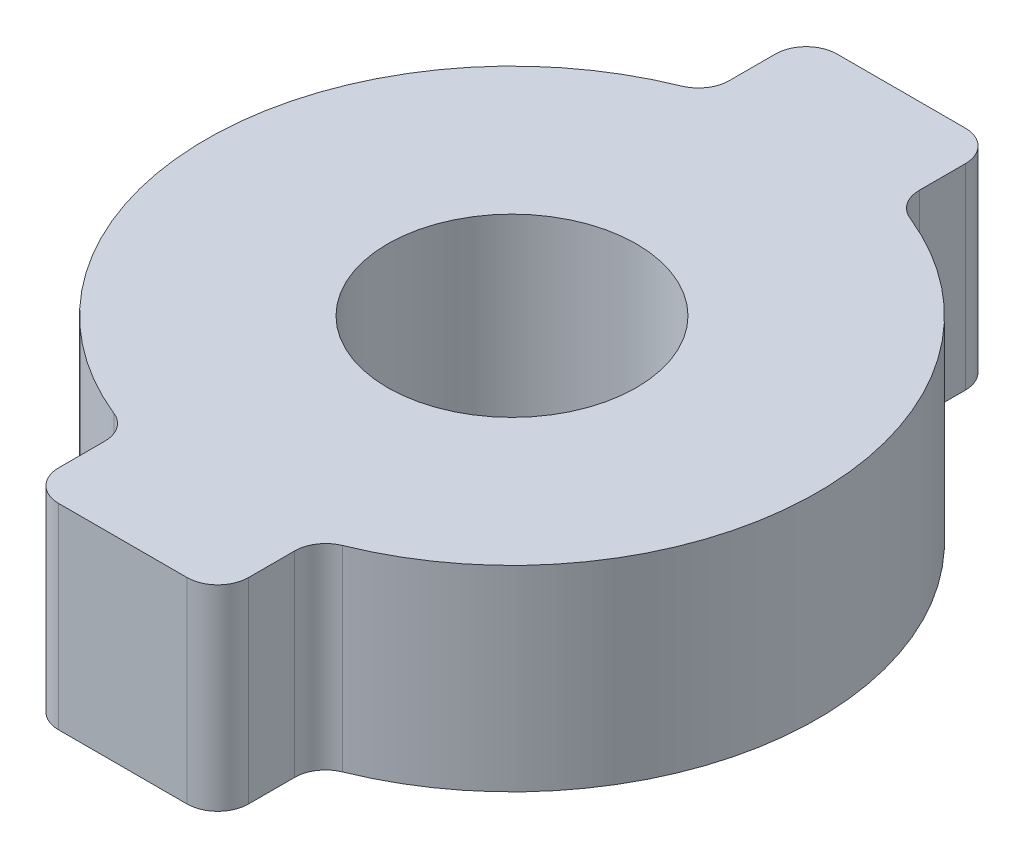
ISO-10303-21;
HEADER;
FILE_DESCRIPTION(('STEP AP214'),'2;1');
FILE_NAME('part.step','',(''),(''),'','','');
FILE_SCHEMA(('AUTOMOTIVE_DESIGN { 1 0 10303 214 1 1 1 1 }'));
ENDSEC;
DATA;
#1=APPLICATION_CONTEXT('core data for automotive mechanical design processes');
#2=APPLICATION_PROTOCOL_DEFINITION('international standard','automotive_design',2000,#1);
#3=PRODUCT_CONTEXT('',#1,'mechanical');
#4=PRODUCT('Part','Part','',(#3));
#5=PRODUCT_RELATED_PRODUCT_CATEGORY('part','',(#4));
#6=PRODUCT_DEFINITION_FORMATION('','',#4);
#7=PRODUCT_DEFINITION_CONTEXT('part definition',#1,'design');
#8=PRODUCT_DEFINITION('design','',#6,#7);
#9=PRODUCT_DEFINITION_SHAPE('','',#8);
#10=(LENGTH_UNIT() NAMED_UNIT(*) SI_UNIT(.MILLI.,.METRE.));
#11=(NAMED_UNIT(*) PLANE_ANGLE_UNIT() SI_UNIT($,.RADIAN.));
#12=(NAMED_UNIT(*) SI_UNIT($,.STERADIAN.) SOLID_ANGLE_UNIT());
#13=UNCERTAINTY_MEASURE_WITH_UNIT(LENGTH_MEASURE(1.E-05),#10,'distance_accuracy_value','');
#14=(GEOMETRIC_REPRESENTATION_CONTEXT(3) GLOBAL_UNCERTAINTY_ASSIGNED_CONTEXT((#13)) GLOBAL_UNIT_ASSIGNED_CONTEXT((#10,
#11,#12)) REPRESENTATION_CONTEXT('',''));
#15=CARTESIAN_POINT('',(0.,0.,0.));
#16=DIRECTION('',(0.,0.,1.));
#17=DIRECTION('',(1.,0.,0.));
#18=AXIS2_PLACEMENT_3D('',#15,#16,#17);
#19=CARTESIAN_POINT('',(0.,6.35,0.));
#20=DIRECTION('',(0.,-1.,0.));
#21=DIRECTION('',(0.,0.,-1.));
#22=AXIS2_PLACEMENT_3D('',#19,#20,#21);
#23=CYLINDRICAL_SURFACE('',#22,9.9);
#24=CARTESIAN_POINT('',(0.,6.35,0.));
#25=DIRECTION('',(0.,1.,0.));
#26=DIRECTION('',(0.,0.,1.));
#27=AXIS2_PLACEMENT_3D('',#24,#25,#26);
#28=CIRCLE('',#27,9.9);
#29=CARTESIAN_POINT('',(-3.70114678899083,6.35,-9.18213006041316));
#30=VERTEX_POINT('',#29);
#31=CARTESIAN_POINT('',(-3.70114678899083,6.35,9.18213006041316));
#32=VERTEX_POINT('',#31);
#33=EDGE_CURVE('E178',#30,#32,#28,.T.);
#34=ORIENTED_EDGE('',*,*,#33,.F.);
#35=DIRECTION('',(0.,-1.,0.));
#36=VECTOR('',#35,1.);
#37=CARTESIAN_POINT('',(-3.70114678899083,6.35,-9.18213006041316));
#38=LINE('',#37,#36);
#39=CARTESIAN_POINT('',(-3.70114678899083,0.,-9.18213006041316));
#40=VERTEX_POINT('',#39);
#41=EDGE_CURVE('E209',#30,#40,#38,.T.);
#42=ORIENTED_EDGE('',*,*,#41,.T.);
#43=CARTESIAN_POINT('',(0.,0.,0.));
#44=DIRECTION('',(0.,1.,0.));
#45=DIRECTION('',(0.,0.,1.));
#46=AXIS2_PLACEMENT_3D('',#43,#44,#45);
#47=CIRCLE('',#46,9.9);
#48=CARTESIAN_POINT('',(-3.70114678899083,0.,9.18213006041316));
#49=VERTEX_POINT('',#48);
#50=EDGE_CURVE('E181',#40,#49,#47,.T.);
#51=ORIENTED_EDGE('',*,*,#50,.T.);
#52=DIRECTION('',(0.,-1.,0.));
#53=VECTOR('',#52,1.);
#54=CARTESIAN_POINT('',(-3.70114678899083,6.35,9.18213006041316));
#55=LINE('',#54,#53);
#56=EDGE_CURVE('E207',#49,#32,#55,.F.);
#57=ORIENTED_EDGE('',*,*,#56,.T.);
#58=EDGE_LOOP('',(#34,#42,#51,#57));
#59=FACE_BOUND('',#58,.T.);
#60=ADVANCED_FACE('F33',(#59),#23,.T.);
#61=CARTESIAN_POINT('',(0.,6.35,0.));
#62=DIRECTION('',(0.,1.,0.));
#63=DIRECTION('',(0.,0.,1.));
#64=AXIS2_PLACEMENT_3D('',#61,#62,#63);
#65=PLANE('',#64);
#66=DIRECTION('',(0.,0.,1.));
#67=VECTOR('',#66,1.);
#68=CARTESIAN_POINT('',(3.075,6.35,-9.41033341598479));
#69=LINE('',#68,#67);
#70=CARTESIAN_POINT('',(3.075,6.35,-11.6));
#71=VERTEX_POINT('',#70);
#72=CARTESIAN_POINT('',(3.075,6.35,-10.1096179453034));
#73=VERTEX_POINT('',#72);
#74=EDGE_CURVE('E260',#71,#73,#69,.T.);
#75=ORIENTED_EDGE('',*,*,#74,.F.);
#76=CARTESIAN_POINT('',(2.075,6.35,-11.6));
#77=DIRECTION('',(0.,1.,0.));
#78=DIRECTION('',(0.,0.,1.));
#79=AXIS2_PLACEMENT_3D('',#76,#77,#78);
#80=CIRCLE('',#79,1.);
#81=CARTESIAN_POINT('',(2.075,6.35,-12.6));
#82=VERTEX_POINT('',#81);
#83=EDGE_CURVE('E172',#71,#82,#80,.T.);
#84=ORIENTED_EDGE('',*,*,#83,.T.);
#85=DIRECTION('',(1.,0.,0.));
#86=VECTOR('',#85,1.);
#87=CARTESIAN_POINT('',(3.075,6.35,-12.6));
#88=LINE('',#87,#86);
#89=CARTESIAN_POINT('',(-2.075,6.35,-12.6));
#90=VERTEX_POINT('',#89);
#91=EDGE_CURVE('E261',#90,#82,#88,.T.);
#92=ORIENTED_EDGE('',*,*,#91,.F.);
#93=CARTESIAN_POINT('',(-2.075,6.35,-11.6));
#94=DIRECTION('',(0.,1.,0.));
#95=DIRECTION('',(0.,0.,1.));
#96=AXIS2_PLACEMENT_3D('',#93,#94,#95);
#97=CIRCLE('',#96,1.);
#98=CARTESIAN_POINT('',(-3.075,6.35,-11.6));
#99=VERTEX_POINT('',#98);
#100=EDGE_CURVE('E199',#90,#99,#97,.T.);
#101=ORIENTED_EDGE('',*,*,#100,.T.);
#102=DIRECTION('',(0.,0.,-1.));
#103=VECTOR('',#102,1.);
#104=CARTESIAN_POINT('',(-3.075,6.35,-12.6));
#105=LINE('',#104,#103);
#106=CARTESIAN_POINT('',(-3.075,6.35,-10.1096179453034));
#107=VERTEX_POINT('',#106);
#108=EDGE_CURVE('E168',#107,#99,#105,.T.);
#109=ORIENTED_EDGE('',*,*,#108,.F.);
#110=CARTESIAN_POINT('',(-4.075,6.35,-10.1096179453034));
#111=DIRECTION('',(0.,1.,0.));
#112=DIRECTION('',(0.,0.,1.));
#113=AXIS2_PLACEMENT_3D('',#110,#111,#112);
#114=CIRCLE('',#113,1.);
#115=EDGE_CURVE('E232',#107,#30,#114,.F.);
#116=ORIENTED_EDGE('',*,*,#115,.T.);
#117=ORIENTED_EDGE('',*,*,#33,.T.);
#118=CARTESIAN_POINT('',(-4.075,6.35,10.1096179453034));
#119=DIRECTION('',(0.,1.,0.));
#120=DIRECTION('',(0.,0.,1.));
#121=AXIS2_PLACEMENT_3D('',#118,#119,#120);
#122=CIRCLE('',#121,1.);
#123=CARTESIAN_POINT('',(-3.075,6.35,10.1096179453034));
#124=VERTEX_POINT('',#123);
#125=EDGE_CURVE('E236',#32,#124,#122,.F.);
#126=ORIENTED_EDGE('',*,*,#125,.T.);
#127=DIRECTION('',(0.,0.,-1.));
#128=VECTOR('',#127,1.);
#129=CARTESIAN_POINT('',(-3.075,6.35,12.6));
#130=LINE('',#129,#128);
#131=CARTESIAN_POINT('',(-3.075,6.35,11.6));
#132=VERTEX_POINT('',#131);
#133=EDGE_CURVE('E273',#132,#124,#130,.T.);
#134=ORIENTED_EDGE('',*,*,#133,.F.);
#135=CARTESIAN_POINT('',(-2.075,6.35,11.6));
#136=DIRECTION('',(0.,1.,0.));
#137=DIRECTION('',(0.,0.,1.));
#138=AXIS2_PLACEMENT_3D('',#135,#136,#137);
#139=CIRCLE('',#138,1.);
#140=CARTESIAN_POINT('',(-2.075,6.35,12.6));
#141=VERTEX_POINT('',#140);
#142=EDGE_CURVE('E197',#132,#141,#139,.T.);
#143=ORIENTED_EDGE('',*,*,#142,.T.);
#144=DIRECTION('',(-1.,0.,0.));
#145=VECTOR('',#144,1.);
#146=CARTESIAN_POINT('',(3.075,6.35,12.6));
#147=LINE('',#146,#145);
#148=CARTESIAN_POINT('',(2.075,6.35,12.6));
#149=VERTEX_POINT('',#148);
#150=EDGE_CURVE('E277',#149,#141,#147,.T.);
#151=ORIENTED_EDGE('',*,*,#150,.F.);
#152=CARTESIAN_POINT('',(2.075,6.35,11.6));
#153=DIRECTION('',(0.,1.,0.));
#154=DIRECTION('',(0.,0.,1.));
#155=AXIS2_PLACEMENT_3D('',#152,#153,#154);
#156=CIRCLE('',#155,1.);
#157=CARTESIAN_POINT('',(3.075,6.35,11.6));
#158=VERTEX_POINT('',#157);
#159=EDGE_CURVE('E48',#149,#158,#156,.T.);
#160=ORIENTED_EDGE('',*,*,#159,.T.);
#161=DIRECTION('',(0.,0.,1.));
#162=VECTOR('',#161,1.);
#163=CARTESIAN_POINT('',(3.075,6.35,9.41033341598479));
#164=LINE('',#163,#162);
#165=CARTESIAN_POINT('',(3.075,6.35,10.1096179453034));
#166=VERTEX_POINT('',#165);
#167=EDGE_CURVE('E254',#166,#158,#164,.T.);
#168=ORIENTED_EDGE('',*,*,#167,.F.);
#169=CARTESIAN_POINT('',(4.075,6.35,10.1096179453034));
#170=DIRECTION('',(0.,1.,0.));
#171=DIRECTION('',(0.,0.,1.));
#172=AXIS2_PLACEMENT_3D('',#169,#170,#171);
#173=CIRCLE('',#172,1.);
#174=CARTESIAN_POINT('',(3.70114678899083,6.35,9.18213006041316));
#175=VERTEX_POINT('',#174);
#176=EDGE_CURVE('E11',#166,#175,#173,.F.);
#177=ORIENTED_EDGE('',*,*,#176,.T.);
#178=CARTESIAN_POINT('',(3.70114678899083,6.35,-9.18213006041316));
#179=VERTEX_POINT('',#178);
#180=EDGE_CURVE('E173',#175,#179,#28,.T.);
#181=ORIENTED_EDGE('',*,*,#180,.T.);
#182=CARTESIAN_POINT('',(4.075,6.35,-10.1096179453034));
#183=DIRECTION('',(0.,1.,0.));
#184=DIRECTION('',(0.,0.,1.));
#185=AXIS2_PLACEMENT_3D('',#182,#183,#184);
#186=CIRCLE('',#185,1.);
#187=EDGE_CURVE('E228',#179,#73,#186,.F.);
#188=ORIENTED_EDGE('',*,*,#187,.T.);
#189=EDGE_LOOP('',(#75,#84,#92,#101,#109,#116,#117,#126,#134,#143,#151,#160,#168,#177,#181,#188));
#190=FACE_BOUND('',#189,.T.);
#191=CARTESIAN_POINT('',(0.,6.35,0.));
#192=DIRECTION('',(0.,1.,0.));
#193=DIRECTION('',(0.,0.,1.));
#194=AXIS2_PLACEMENT_3D('',#191,#192,#193);
#195=CIRCLE('',#194,4.03);
#196=CARTESIAN_POINT('',(0.,6.35,4.03));
#197=VERTEX_POINT('',#196);
#198=EDGE_CURVE('E283',#197,#197,#195,.T.);
#199=ORIENTED_EDGE('',*,*,#198,.F.);
#200=EDGE_LOOP('',(#199));
#201=FACE_BOUND('',#200,.T.);
#202=ADVANCED_FACE('F251',(#190,#201),#65,.T.);
#203=CARTESIAN_POINT('',(0.,0.,0.));
#204=DIRECTION('',(0.,1.,0.));
#205=DIRECTION('',(0.,0.,1.));
#206=AXIS2_PLACEMENT_3D('',#203,#204,#205);
#207=PLANE('',#206);
#208=DIRECTION('',(1.,0.,0.));
#209=VECTOR('',#208,1.);
#210=CARTESIAN_POINT('',(3.075,0.,-12.6));
#211=LINE('',#210,#209);
#212=CARTESIAN_POINT('',(-2.075,0.,-12.6));
#213=VERTEX_POINT('',#212);
#214=CARTESIAN_POINT('',(2.075,0.,-12.6));
#215=VERTEX_POINT('',#214);
#216=EDGE_CURVE('E153',#213,#215,#211,.T.);
#217=ORIENTED_EDGE('',*,*,#216,.T.);
#218=CARTESIAN_POINT('',(2.075,0.,-11.6));
#219=DIRECTION('',(0.,1.,0.));
#220=DIRECTION('',(0.,0.,1.));
#221=AXIS2_PLACEMENT_3D('',#218,#219,#220);
#222=CIRCLE('',#221,1.);
#223=CARTESIAN_POINT('',(3.075,0.,-11.6));
#224=VERTEX_POINT('',#223);
#225=EDGE_CURVE('E147',#215,#224,#222,.F.);
#226=ORIENTED_EDGE('',*,*,#225,.T.);
#227=DIRECTION('',(0.,0.,1.));
#228=VECTOR('',#227,1.);
#229=CARTESIAN_POINT('',(3.075,0.,-9.41033341598479));
#230=LINE('',#229,#228);
#231=CARTESIAN_POINT('',(3.075,0.,-10.1096179453034));
#232=VERTEX_POINT('',#231);
#233=EDGE_CURVE('E151',#224,#232,#230,.T.);
#234=ORIENTED_EDGE('',*,*,#233,.T.);
#235=CARTESIAN_POINT('',(4.075,0.,-10.1096179453034));
#236=DIRECTION('',(0.,1.,0.));
#237=DIRECTION('',(0.,0.,1.));
#238=AXIS2_PLACEMENT_3D('',#235,#236,#237);
#239=CIRCLE('',#238,1.);
#240=CARTESIAN_POINT('',(3.70114678899083,0.,-9.18213006041316));
#241=VERTEX_POINT('',#240);
#242=EDGE_CURVE('E226',#232,#241,#239,.T.);
#243=ORIENTED_EDGE('',*,*,#242,.T.);
#244=CARTESIAN_POINT('',(3.70114678899083,0.,9.18213006041316));
#245=VERTEX_POINT('',#244);
#246=EDGE_CURVE('E241',#245,#241,#47,.T.);
#247=ORIENTED_EDGE('',*,*,#246,.F.);
#248=CARTESIAN_POINT('',(4.075,0.,10.1096179453034));
#249=DIRECTION('',(0.,1.,0.));
#250=DIRECTION('',(0.,0.,1.));
#251=AXIS2_PLACEMENT_3D('',#248,#249,#250);
#252=CIRCLE('',#251,1.);
#253=CARTESIAN_POINT('',(3.075,0.,10.1096179453034));
#254=VERTEX_POINT('',#253);
#255=EDGE_CURVE('E41',#245,#254,#252,.T.);
#256=ORIENTED_EDGE('',*,*,#255,.T.);
#257=DIRECTION('',(0.,0.,1.));
#258=VECTOR('',#257,1.);
#259=CARTESIAN_POINT('',(3.075,0.,9.41033341598479));
#260=LINE('',#259,#258);
#261=CARTESIAN_POINT('',(3.075,0.,11.6));
#262=VERTEX_POINT('',#261);
#263=EDGE_CURVE('E239',#254,#262,#260,.T.);
#264=ORIENTED_EDGE('',*,*,#263,.T.);
#265=CARTESIAN_POINT('',(2.075,0.,11.6));
#266=DIRECTION('',(0.,1.,0.));
#267=DIRECTION('',(0.,0.,1.));
#268=AXIS2_PLACEMENT_3D('',#265,#266,#267);
#269=CIRCLE('',#268,1.);
#270=CARTESIAN_POINT('',(2.075,0.,12.6));
#271=VERTEX_POINT('',#270);
#272=EDGE_CURVE('E191',#262,#271,#269,.F.);
#273=ORIENTED_EDGE('',*,*,#272,.T.);
#274=DIRECTION('',(-1.,0.,0.));
#275=VECTOR('',#274,1.);
#276=CARTESIAN_POINT('',(3.075,0.,12.6));
#277=LINE('',#276,#275);
#278=CARTESIAN_POINT('',(-2.075,0.,12.6));
#279=VERTEX_POINT('',#278);
#280=EDGE_CURVE('E246',#271,#279,#277,.T.);
#281=ORIENTED_EDGE('',*,*,#280,.T.);
#282=CARTESIAN_POINT('',(-2.075,0.,11.6));
#283=DIRECTION('',(0.,1.,0.));
#284=DIRECTION('',(0.,0.,1.));
#285=AXIS2_PLACEMENT_3D('',#282,#283,#284);
#286=CIRCLE('',#285,1.);
#287=CARTESIAN_POINT('',(-3.075,0.,11.6));
#288=VERTEX_POINT('',#287);
#289=EDGE_CURVE('E193',#279,#288,#286,.F.);
#290=ORIENTED_EDGE('',*,*,#289,.T.);
#291=DIRECTION('',(0.,0.,-1.));
#292=VECTOR('',#291,1.);
#293=CARTESIAN_POINT('',(-3.075,0.,12.6));
#294=LINE('',#293,#292);
#295=CARTESIAN_POINT('',(-3.075,0.,10.1096179453034));
#296=VERTEX_POINT('',#295);
#297=EDGE_CURVE('E247',#288,#296,#294,.T.);
#298=ORIENTED_EDGE('',*,*,#297,.T.);
#299=CARTESIAN_POINT('',(-4.075,0.,10.1096179453034));
#300=DIRECTION('',(0.,1.,0.));
#301=DIRECTION('',(0.,0.,1.));
#302=AXIS2_PLACEMENT_3D('',#299,#300,#301);
#303=CIRCLE('',#302,1.);
#304=EDGE_CURVE('E234',#296,#49,#303,.T.);
#305=ORIENTED_EDGE('',*,*,#304,.T.);
#306=ORIENTED_EDGE('',*,*,#50,.F.);
#307=CARTESIAN_POINT('',(-4.075,0.,-10.1096179453034));
#308=DIRECTION('',(0.,1.,0.));
#309=DIRECTION('',(0.,0.,1.));
#310=AXIS2_PLACEMENT_3D('',#307,#308,#309);
#311=CIRCLE('',#310,1.);
#312=CARTESIAN_POINT('',(-3.075,0.,-10.1096179453034));
#313=VERTEX_POINT('',#312);
#314=EDGE_CURVE('E230',#40,#313,#311,.T.);
#315=ORIENTED_EDGE('',*,*,#314,.T.);
#316=DIRECTION('',(0.,0.,-1.));
#317=VECTOR('',#316,1.);
#318=CARTESIAN_POINT('',(-3.075,0.,-12.6));
#319=LINE('',#318,#317);
#320=CARTESIAN_POINT('',(-3.075,0.,-11.6));
#321=VERTEX_POINT('',#320);
#322=EDGE_CURVE('E269',#313,#321,#319,.T.);
#323=ORIENTED_EDGE('',*,*,#322,.T.);
#324=CARTESIAN_POINT('',(-2.075,0.,-11.6));
#325=DIRECTION('',(0.,1.,0.));
#326=DIRECTION('',(0.,0.,1.));
#327=AXIS2_PLACEMENT_3D('',#324,#325,#326);
#328=CIRCLE('',#327,1.);
#329=EDGE_CURVE('E158',#321,#213,#328,.F.);
#330=ORIENTED_EDGE('',*,*,#329,.T.);
#331=EDGE_LOOP('',(#217,#226,#234,#243,#247,#256,#264,#273,#281,#290,#298,#305,#306,#315,#323,#330));
#332=FACE_BOUND('',#331,.T.);
#333=CARTESIAN_POINT('',(0.,0.,0.));
#334=DIRECTION('',(0.,1.,0.));
#335=DIRECTION('',(0.,0.,1.));
#336=AXIS2_PLACEMENT_3D('',#333,#334,#335);
#337=CIRCLE('',#336,4.03);
#338=CARTESIAN_POINT('',(0.,0.,4.03));
#339=VERTEX_POINT('',#338);
#340=EDGE_CURVE('E279',#339,#339,#337,.T.);
#341=ORIENTED_EDGE('',*,*,#340,.T.);
#342=EDGE_LOOP('',(#341));
#343=FACE_BOUND('',#342,.T.);
#344=ADVANCED_FACE('F149',(#332,#343),#207,.F.);
#345=ORIENTED_EDGE('',*,*,#246,.T.);
#346=DIRECTION('',(0.,-1.,0.));
#347=VECTOR('',#346,1.);
#348=CARTESIAN_POINT('',(3.70114678899083,6.35,-9.18213006041316));
#349=LINE('',#348,#347);
#350=EDGE_CURVE('E185',#241,#179,#349,.F.);
#351=ORIENTED_EDGE('',*,*,#350,.T.);
#352=ORIENTED_EDGE('',*,*,#180,.F.);
#353=DIRECTION('',(0.,-1.,0.));
#354=VECTOR('',#353,1.);
#355=CARTESIAN_POINT('',(3.70114678899083,6.35,9.18213006041316));
#356=LINE('',#355,#354);
#357=EDGE_CURVE('E175',#175,#245,#356,.T.);
#358=ORIENTED_EDGE('',*,*,#357,.T.);
#359=EDGE_LOOP('',(#345,#351,#352,#358));
#360=FACE_BOUND('',#359,.T.);
#361=ADVANCED_FACE('F256',(#360),#23,.T.);
#362=CARTESIAN_POINT('',(0.,6.35,0.));
#363=DIRECTION('',(0.,-1.,0.));
#364=DIRECTION('',(0.,0.,-1.));
#365=AXIS2_PLACEMENT_3D('',#362,#363,#364);
#366=CYLINDRICAL_SURFACE('',#365,4.03);
#367=ORIENTED_EDGE('',*,*,#198,.T.);
#368=EDGE_LOOP('',(#367));
#369=FACE_BOUND('',#368,.T.);
#370=ORIENTED_EDGE('',*,*,#340,.F.);
#371=EDGE_LOOP('',(#370));
#372=FACE_BOUND('',#371,.T.);
#373=ADVANCED_FACE('F328',(#369,#372),#366,.F.);
#374=CARTESIAN_POINT('',(-3.075,6.35,12.6));
#375=DIRECTION('',(-1.,0.,0.));
#376=DIRECTION('',(0.,0.,1.));
#377=AXIS2_PLACEMENT_3D('',#374,#375,#376);
#378=PLANE('',#377);
#379=ORIENTED_EDGE('',*,*,#133,.T.);
#380=DIRECTION('',(0.,-1.,0.));
#381=VECTOR('',#380,1.);
#382=CARTESIAN_POINT('',(-3.075,6.35,10.1096179453034));
#383=LINE('',#382,#381);
#384=EDGE_CURVE('E214',#124,#296,#383,.T.);
#385=ORIENTED_EDGE('',*,*,#384,.T.);
#386=ORIENTED_EDGE('',*,*,#297,.F.);
#387=DIRECTION('',(0.,-1.,0.));
#388=VECTOR('',#387,1.);
#389=CARTESIAN_POINT('',(-3.075,6.35,11.6));
#390=LINE('',#389,#388);
#391=EDGE_CURVE('E212',#288,#132,#390,.F.);
#392=ORIENTED_EDGE('',*,*,#391,.T.);
#393=EDGE_LOOP('',(#379,#385,#386,#392));
#394=FACE_BOUND('',#393,.T.);
#395=ADVANCED_FACE('F301',(#394),#378,.T.);
#396=CARTESIAN_POINT('',(3.075,6.35,12.6));
#397=DIRECTION('',(0.,0.,1.));
#398=DIRECTION('',(1.,0.,0.));
#399=AXIS2_PLACEMENT_3D('',#396,#397,#398);
#400=PLANE('',#399);
#401=ORIENTED_EDGE('',*,*,#150,.T.);
#402=DIRECTION('',(0.,-1.,0.));
#403=VECTOR('',#402,1.);
#404=CARTESIAN_POINT('',(-2.075,6.35,12.6));
#405=LINE('',#404,#403);
#406=EDGE_CURVE('E219',#141,#279,#405,.T.);
#407=ORIENTED_EDGE('',*,*,#406,.T.);
#408=ORIENTED_EDGE('',*,*,#280,.F.);
#409=DIRECTION('',(0.,-1.,0.));
#410=VECTOR('',#409,1.);
#411=CARTESIAN_POINT('',(2.075,6.35,12.6));
#412=LINE('',#411,#410);
#413=EDGE_CURVE('E217',#271,#149,#412,.F.);
#414=ORIENTED_EDGE('',*,*,#413,.T.);
#415=EDGE_LOOP('',(#401,#407,#408,#414));
#416=FACE_BOUND('',#415,.T.);
#417=ADVANCED_FACE('F308',(#416),#400,.T.);
#418=CARTESIAN_POINT('',(3.075,6.35,9.41033341598479));
#419=DIRECTION('',(1.,0.,0.));
#420=DIRECTION('',(0.,0.,-1.));
#421=AXIS2_PLACEMENT_3D('',#418,#419,#420);
#422=PLANE('',#421);
#423=ORIENTED_EDGE('',*,*,#167,.T.);
#424=DIRECTION('',(0.,-1.,0.));
#425=VECTOR('',#424,1.);
#426=CARTESIAN_POINT('',(3.075,6.35,11.6));
#427=LINE('',#426,#425);
#428=EDGE_CURVE('E223',#158,#262,#427,.T.);
#429=ORIENTED_EDGE('',*,*,#428,.T.);
#430=ORIENTED_EDGE('',*,*,#263,.F.);
#431=DIRECTION('',(0.,-1.,0.));
#432=VECTOR('',#431,1.);
#433=CARTESIAN_POINT('',(3.075,6.35,10.1096179453034));
#434=LINE('',#433,#432);
#435=EDGE_CURVE('E55',#254,#166,#434,.F.);
#436=ORIENTED_EDGE('',*,*,#435,.T.);
#437=EDGE_LOOP('',(#423,#429,#430,#436));
#438=FACE_BOUND('',#437,.T.);
#439=ADVANCED_FACE('F244',(#438),#422,.T.);
#440=CARTESIAN_POINT('',(-3.075,6.35,-12.6));
#441=DIRECTION('',(-1.,0.,0.));
#442=DIRECTION('',(0.,0.,1.));
#443=AXIS2_PLACEMENT_3D('',#440,#441,#442);
#444=PLANE('',#443);
#445=ORIENTED_EDGE('',*,*,#108,.T.);
#446=DIRECTION('',(0.,-1.,0.));
#447=VECTOR('',#446,1.);
#448=CARTESIAN_POINT('',(-3.075,6.35,-11.6));
#449=LINE('',#448,#447);
#450=EDGE_CURVE('E204',#99,#321,#449,.T.);
#451=ORIENTED_EDGE('',*,*,#450,.T.);
#452=ORIENTED_EDGE('',*,*,#322,.F.);
#453=DIRECTION('',(0.,-1.,0.));
#454=VECTOR('',#453,1.);
#455=CARTESIAN_POINT('',(-3.075,6.35,-10.1096179453034));
#456=LINE('',#455,#454);
#457=EDGE_CURVE('E202',#313,#107,#456,.F.);
#458=ORIENTED_EDGE('',*,*,#457,.T.);
#459=EDGE_LOOP('',(#445,#451,#452,#458));
#460=FACE_BOUND('',#459,.T.);
#461=ADVANCED_FACE('F342',(#460),#444,.T.);
#462=CARTESIAN_POINT('',(3.075,6.35,-9.41033341598479));
#463=DIRECTION('',(1.,0.,0.));
#464=DIRECTION('',(0.,0.,-1.));
#465=AXIS2_PLACEMENT_3D('',#462,#463,#464);
#466=PLANE('',#465);
#467=ORIENTED_EDGE('',*,*,#74,.T.);
#468=DIRECTION('',(0.,-1.,0.));
#469=VECTOR('',#468,1.);
#470=CARTESIAN_POINT('',(3.075,6.35,-10.1096179453034));
#471=LINE('',#470,#469);
#472=EDGE_CURVE('E167',#73,#232,#471,.T.);
#473=ORIENTED_EDGE('',*,*,#472,.T.);
#474=ORIENTED_EDGE('',*,*,#233,.F.);
#475=DIRECTION('',(0.,-1.,0.));
#476=VECTOR('',#475,1.);
#477=CARTESIAN_POINT('',(3.075,6.35,-11.6));
#478=LINE('',#477,#476);
#479=EDGE_CURVE('E164',#224,#71,#478,.F.);
#480=ORIENTED_EDGE('',*,*,#479,.T.);
#481=EDGE_LOOP('',(#467,#473,#474,#480));
#482=FACE_BOUND('',#481,.T.);
#483=ADVANCED_FACE('F163',(#482),#466,.T.);
#484=CARTESIAN_POINT('',(3.075,6.35,-12.6));
#485=DIRECTION('',(0.,0.,-1.));
#486=DIRECTION('',(-1.,0.,0.));
#487=AXIS2_PLACEMENT_3D('',#484,#485,#486);
#488=PLANE('',#487);
#489=ORIENTED_EDGE('',*,*,#91,.T.);
#490=DIRECTION('',(0.,-1.,0.));
#491=VECTOR('',#490,1.);
#492=CARTESIAN_POINT('',(2.075,6.35,-12.6));
#493=LINE('',#492,#491);
#494=EDGE_CURVE('E189',#82,#215,#493,.T.);
#495=ORIENTED_EDGE('',*,*,#494,.T.);
#496=ORIENTED_EDGE('',*,*,#216,.F.);
#497=DIRECTION('',(0.,-1.,0.));
#498=VECTOR('',#497,1.);
#499=CARTESIAN_POINT('',(-2.075,6.35,-12.6));
#500=LINE('',#499,#498);
#501=EDGE_CURVE('E187',#213,#90,#500,.F.);
#502=ORIENTED_EDGE('',*,*,#501,.T.);
#503=EDGE_LOOP('',(#489,#495,#496,#502));
#504=FACE_BOUND('',#503,.T.);
#505=ADVANCED_FACE('F348',(#504),#488,.T.);
#506=CARTESIAN_POINT('',(4.075,6.35,-10.1096179453034));
#507=DIRECTION('',(0.,-1.,0.));
#508=DIRECTION('',(0.,0.,-1.));
#509=AXIS2_PLACEMENT_3D('',#506,#507,#508);
#510=CYLINDRICAL_SURFACE('',#509,1.);
#511=ORIENTED_EDGE('',*,*,#187,.F.);
#512=ORIENTED_EDGE('',*,*,#350,.F.);
#513=ORIENTED_EDGE('',*,*,#242,.F.);
#514=ORIENTED_EDGE('',*,*,#472,.F.);
#515=EDGE_LOOP('',(#511,#512,#513,#514));
#516=FACE_BOUND('',#515,.T.);
#517=ADVANCED_FACE('F259',(#516),#510,.F.);
#518=CARTESIAN_POINT('',(2.075,6.35,-11.6));
#519=DIRECTION('',(0.,-1.,0.));
#520=DIRECTION('',(0.,0.,-1.));
#521=AXIS2_PLACEMENT_3D('',#518,#519,#520);
#522=CYLINDRICAL_SURFACE('',#521,1.);
#523=ORIENTED_EDGE('',*,*,#83,.F.);
#524=ORIENTED_EDGE('',*,*,#479,.F.);
#525=ORIENTED_EDGE('',*,*,#225,.F.);
#526=ORIENTED_EDGE('',*,*,#494,.F.);
#527=EDGE_LOOP('',(#523,#524,#525,#526));
#528=FACE_BOUND('',#527,.T.);
#529=ADVANCED_FACE('F171',(#528),#522,.T.);
#530=CARTESIAN_POINT('',(-2.075,6.35,-11.6));
#531=DIRECTION('',(0.,-1.,0.));
#532=DIRECTION('',(0.,0.,-1.));
#533=AXIS2_PLACEMENT_3D('',#530,#531,#532);
#534=CYLINDRICAL_SURFACE('',#533,1.);
#535=ORIENTED_EDGE('',*,*,#100,.F.);
#536=ORIENTED_EDGE('',*,*,#501,.F.);
#537=ORIENTED_EDGE('',*,*,#329,.F.);
#538=ORIENTED_EDGE('',*,*,#450,.F.);
#539=EDGE_LOOP('',(#535,#536,#537,#538));
#540=FACE_BOUND('',#539,.T.);
#541=ADVANCED_FACE('F372',(#540),#534,.T.);
#542=CARTESIAN_POINT('',(-4.075,6.35,-10.1096179453034));
#543=DIRECTION('',(0.,-1.,0.));
#544=DIRECTION('',(0.,0.,-1.));
#545=AXIS2_PLACEMENT_3D('',#542,#543,#544);
#546=CYLINDRICAL_SURFACE('',#545,1.);
#547=ORIENTED_EDGE('',*,*,#115,.F.);
#548=ORIENTED_EDGE('',*,*,#457,.F.);
#549=ORIENTED_EDGE('',*,*,#314,.F.);
#550=ORIENTED_EDGE('',*,*,#41,.F.);
#551=EDGE_LOOP('',(#547,#548,#549,#550));
#552=FACE_BOUND('',#551,.T.);
#553=ADVANCED_FACE('F379',(#552),#546,.F.);
#554=CARTESIAN_POINT('',(-4.075,6.35,10.1096179453034));
#555=DIRECTION('',(0.,-1.,0.));
#556=DIRECTION('',(0.,0.,-1.));
#557=AXIS2_PLACEMENT_3D('',#554,#555,#556);
#558=CYLINDRICAL_SURFACE('',#557,1.);
#559=ORIENTED_EDGE('',*,*,#125,.F.);
#560=ORIENTED_EDGE('',*,*,#56,.F.);
#561=ORIENTED_EDGE('',*,*,#304,.F.);
#562=ORIENTED_EDGE('',*,*,#384,.F.);
#563=EDGE_LOOP('',(#559,#560,#561,#562));
#564=FACE_BOUND('',#563,.T.);
#565=ADVANCED_FACE('F296',(#564),#558,.F.);
#566=CARTESIAN_POINT('',(-2.075,6.35,11.6));
#567=DIRECTION('',(0.,-1.,0.));
#568=DIRECTION('',(0.,0.,-1.));
#569=AXIS2_PLACEMENT_3D('',#566,#567,#568);
#570=CYLINDRICAL_SURFACE('',#569,1.);
#571=ORIENTED_EDGE('',*,*,#142,.F.);
#572=ORIENTED_EDGE('',*,*,#391,.F.);
#573=ORIENTED_EDGE('',*,*,#289,.F.);
#574=ORIENTED_EDGE('',*,*,#406,.F.);
#575=EDGE_LOOP('',(#571,#572,#573,#574));
#576=FACE_BOUND('',#575,.T.);
#577=ADVANCED_FACE('F305',(#576),#570,.T.);
#578=CARTESIAN_POINT('',(2.075,6.35,11.6));
#579=DIRECTION('',(0.,-1.,0.));
#580=DIRECTION('',(0.,0.,-1.));
#581=AXIS2_PLACEMENT_3D('',#578,#579,#580);
#582=CYLINDRICAL_SURFACE('',#581,1.);
#583=ORIENTED_EDGE('',*,*,#159,.F.);
#584=ORIENTED_EDGE('',*,*,#413,.F.);
#585=ORIENTED_EDGE('',*,*,#272,.F.);
#586=ORIENTED_EDGE('',*,*,#428,.F.);
#587=EDGE_LOOP('',(#583,#584,#585,#586));
#588=FACE_BOUND('',#587,.T.);
#589=ADVANCED_FACE('F312',(#588),#582,.T.);
#590=CARTESIAN_POINT('',(4.075,6.35,10.1096179453034));
#591=DIRECTION('',(0.,-1.,0.));
#592=DIRECTION('',(0.,0.,-1.));
#593=AXIS2_PLACEMENT_3D('',#590,#591,#592);
#594=CYLINDRICAL_SURFACE('',#593,1.);
#595=ORIENTED_EDGE('',*,*,#176,.F.);
#596=ORIENTED_EDGE('',*,*,#435,.F.);
#597=ORIENTED_EDGE('',*,*,#255,.F.);
#598=ORIENTED_EDGE('',*,*,#357,.F.);
#599=EDGE_LOOP('',(#595,#596,#597,#598));
#600=FACE_BOUND('',#599,.T.);
#601=ADVANCED_FACE('F35',(#600),#594,.F.);
#602=CLOSED_SHELL('',(#60,#202,#344,#361,#373,#395,#417,#439,#461,#483,#505,#517,#529,#541,#553,
#565,#577,#589,#601));
#603=MANIFOLD_SOLID_BREP('B2',#602);
#604=ADVANCED_BREP_SHAPE_REPRESENTATION('',(#18,#603),#14);
#605=SHAPE_DEFINITION_REPRESENTATION(#9,#604);
ENDSEC;
END-ISO-10303-21;
